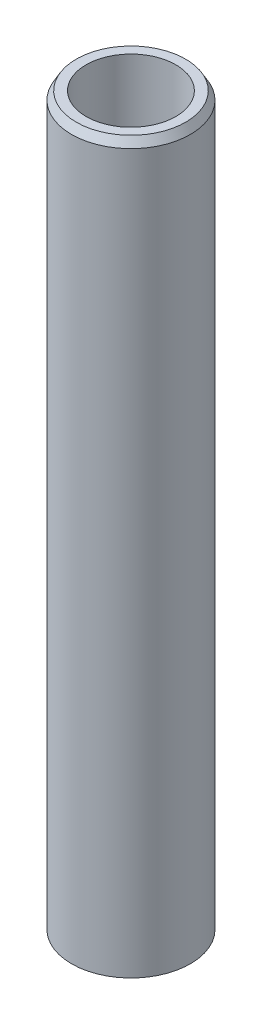
ISO-10303-21;
HEADER;
FILE_DESCRIPTION(('STEP AP214'),'2;1');
FILE_NAME('part.step','',(''),(''),'','','');
FILE_SCHEMA(('AUTOMOTIVE_DESIGN { 1 0 10303 214 1 1 1 1 }'));
ENDSEC;
DATA;
#1=APPLICATION_CONTEXT('core data for automotive mechanical design processes');
#2=APPLICATION_PROTOCOL_DEFINITION('international standard','automotive_design',2000,#1);
#3=PRODUCT_CONTEXT('',#1,'mechanical');
#4=PRODUCT('Part','Part','',(#3));
#5=PRODUCT_RELATED_PRODUCT_CATEGORY('part','',(#4));
#6=PRODUCT_DEFINITION_FORMATION('','',#4);
#7=PRODUCT_DEFINITION_CONTEXT('part definition',#1,'design');
#8=PRODUCT_DEFINITION('design','',#6,#7);
#9=PRODUCT_DEFINITION_SHAPE('','',#8);
#10=(LENGTH_UNIT() NAMED_UNIT(*) SI_UNIT(.MILLI.,.METRE.));
#11=(NAMED_UNIT(*) PLANE_ANGLE_UNIT() SI_UNIT($,.RADIAN.));
#12=(NAMED_UNIT(*) SI_UNIT($,.STERADIAN.) SOLID_ANGLE_UNIT());
#13=UNCERTAINTY_MEASURE_WITH_UNIT(LENGTH_MEASURE(1.E-05),#10,'distance_accuracy_value','');
#14=(GEOMETRIC_REPRESENTATION_CONTEXT(3) GLOBAL_UNCERTAINTY_ASSIGNED_CONTEXT((#13)) GLOBAL_UNIT_ASSIGNED_CONTEXT((#10,
#11,#12)) REPRESENTATION_CONTEXT('',''));
#15=CARTESIAN_POINT('',(0.,0.,0.));
#16=DIRECTION('',(0.,0.,1.));
#17=DIRECTION('',(1.,0.,0.));
#18=AXIS2_PLACEMENT_3D('',#15,#16,#17);
#19=CARTESIAN_POINT('',(0.,399.860888022318,0.));
#20=DIRECTION('',(0.,-1.,0.));
#21=DIRECTION('',(0.,0.,-1.));
#22=AXIS2_PLACEMENT_3D('',#19,#20,#21);
#23=CYLINDRICAL_SURFACE('',#22,32.5);
#24=CARTESIAN_POINT('',(0.,395.361664524214,0.));
#25=DIRECTION('',(0.,1.,0.));
#26=DIRECTION('',(0.,0.,1.));
#27=AXIS2_PLACEMENT_3D('',#24,#25,#26);
#28=CIRCLE('',#27,32.5);
#29=CARTESIAN_POINT('',(0.,395.361664524214,32.5));
#30=VERTEX_POINT('',#29);
#31=EDGE_CURVE('E50',#30,#30,#28,.F.);
#32=ORIENTED_EDGE('',*,*,#31,.T.);
#33=EDGE_LOOP('',(#32));
#34=FACE_BOUND('',#33,.T.);
#35=CARTESIAN_POINT('',(0.,2.5976278977744,0.));
#36=DIRECTION('',(0.,1.,0.));
#37=DIRECTION('',(0.,0.,1.));
#38=AXIS2_PLACEMENT_3D('',#35,#36,#37);
#39=CIRCLE('',#38,32.5);
#40=CARTESIAN_POINT('',(0.,2.5976278977744,32.5));
#41=VERTEX_POINT('',#40);
#42=EDGE_CURVE('E51',#41,#41,#39,.T.);
#43=ORIENTED_EDGE('',*,*,#42,.T.);
#44=EDGE_LOOP('',(#43));
#45=FACE_BOUND('',#44,.T.);
#46=ADVANCED_FACE('F39',(#34,#45),#23,.T.);
#47=CARTESIAN_POINT('',(0.,399.860888022318,0.));
#48=DIRECTION('',(0.,1.,0.));
#49=DIRECTION('',(0.,0.,1.));
#50=AXIS2_PLACEMENT_3D('',#47,#48,#49);
#51=PLANE('',#50);
#52=CARTESIAN_POINT('',(0.,399.860888022318,0.));
#53=DIRECTION('',(0.,1.,0.));
#54=DIRECTION('',(0.,0.,1.));
#55=AXIS2_PLACEMENT_3D('',#52,#53,#54);
#56=CIRCLE('',#55,29.9023721022255);
#57=CARTESIAN_POINT('',(0.,399.860888022318,29.9023721022255));
#58=VERTEX_POINT('',#57);
#59=EDGE_CURVE('E54',#58,#58,#56,.T.);
#60=ORIENTED_EDGE('',*,*,#59,.T.);
#61=EDGE_LOOP('',(#60));
#62=FACE_BOUND('',#61,.T.);
#63=CARTESIAN_POINT('',(0.,399.860888022318,0.));
#64=DIRECTION('',(0.,1.,0.));
#65=DIRECTION('',(0.,0.,1.));
#66=AXIS2_PLACEMENT_3D('',#63,#64,#65);
#67=CIRCLE('',#66,24.5360841344724);
#68=CARTESIAN_POINT('',(0.,399.860888022318,24.5360841344724));
#69=VERTEX_POINT('',#68);
#70=EDGE_CURVE('E58',#69,#69,#67,.T.);
#71=ORIENTED_EDGE('',*,*,#70,.F.);
#72=EDGE_LOOP('',(#71));
#73=FACE_BOUND('',#72,.T.);
#74=ADVANCED_FACE('F69',(#62,#73),#51,.T.);
#75=CARTESIAN_POINT('',(0.,0.,0.));
#76=DIRECTION('',(0.,1.,0.));
#77=DIRECTION('',(0.,0.,1.));
#78=AXIS2_PLACEMENT_3D('',#75,#76,#77);
#79=PLANE('',#78);
#80=CARTESIAN_POINT('',(0.,0.,0.));
#81=DIRECTION('',(0.,1.,0.));
#82=DIRECTION('',(0.,0.,1.));
#83=AXIS2_PLACEMENT_3D('',#80,#81,#82);
#84=CIRCLE('',#83,28.0007765018963);
#85=CARTESIAN_POINT('',(0.,0.,28.0007765018963));
#86=VERTEX_POINT('',#85);
#87=EDGE_CURVE('E10',#86,#86,#84,.F.);
#88=ORIENTED_EDGE('',*,*,#87,.T.);
#89=EDGE_LOOP('',(#88));
#90=FACE_BOUND('',#89,.T.);
#91=CARTESIAN_POINT('',(0.,0.,0.));
#92=DIRECTION('',(0.,1.,0.));
#93=DIRECTION('',(0.,0.,1.));
#94=AXIS2_PLACEMENT_3D('',#91,#92,#93);
#95=CIRCLE('',#94,24.5360841344724);
#96=CARTESIAN_POINT('',(0.,0.,24.5360841344724));
#97=VERTEX_POINT('',#96);
#98=EDGE_CURVE('E63',#97,#97,#95,.T.);
#99=ORIENTED_EDGE('',*,*,#98,.T.);
#100=EDGE_LOOP('',(#99));
#101=FACE_BOUND('',#100,.T.);
#102=ADVANCED_FACE('F75',(#90,#101),#79,.F.);
#103=CARTESIAN_POINT('',(0.,399.860888022318,0.));
#104=DIRECTION('',(0.,-1.,0.));
#105=DIRECTION('',(0.,0.,-1.));
#106=AXIS2_PLACEMENT_3D('',#103,#104,#105);
#107=CYLINDRICAL_SURFACE('',#106,24.5360841344724);
#108=ORIENTED_EDGE('',*,*,#70,.T.);
#109=EDGE_LOOP('',(#108));
#110=FACE_BOUND('',#109,.T.);
#111=ORIENTED_EDGE('',*,*,#98,.F.);
#112=EDGE_LOOP('',(#111));
#113=FACE_BOUND('',#112,.T.);
#114=ADVANCED_FACE('F70',(#110,#113),#107,.F.);
#115=CARTESIAN_POINT('',(0.,399.860888022318,0.));
#116=DIRECTION('',(0.,-1.,0.));
#117=DIRECTION('',(0.,0.,-1.));
#118=AXIS2_PLACEMENT_3D('',#115,#116,#117);
#119=CONICAL_SURFACE('',#118,29.9023721022255,0.523598775598301);
#120=ORIENTED_EDGE('',*,*,#31,.F.);
#121=EDGE_LOOP('',(#120));
#122=FACE_BOUND('',#121,.T.);
#123=ORIENTED_EDGE('',*,*,#59,.F.);
#124=EDGE_LOOP('',(#123));
#125=FACE_BOUND('',#124,.T.);
#126=ADVANCED_FACE('F81',(#122,#125),#119,.T.);
#127=CARTESIAN_POINT('',(0.,2.5976278977744,0.));
#128=DIRECTION('',(0.,1.,0.));
#129=DIRECTION('',(0.,0.,1.));
#130=AXIS2_PLACEMENT_3D('',#127,#128,#129);
#131=CONICAL_SURFACE('',#130,32.5,1.04719755119661);
#132=ORIENTED_EDGE('',*,*,#87,.F.);
#133=EDGE_LOOP('',(#132));
#134=FACE_BOUND('',#133,.T.);
#135=ORIENTED_EDGE('',*,*,#42,.F.);
#136=EDGE_LOOP('',(#135));
#137=FACE_BOUND('',#136,.T.);
#138=ADVANCED_FACE('F45',(#134,#137),#131,.T.);
#139=CLOSED_SHELL('',(#46,#74,#102,#114,#126,#138));
#140=MANIFOLD_SOLID_BREP('B2',#139);
#141=ADVANCED_BREP_SHAPE_REPRESENTATION('',(#18,#140),#14);
#142=SHAPE_DEFINITION_REPRESENTATION(#9,#141);
ENDSEC;
END-ISO-10303-21;
